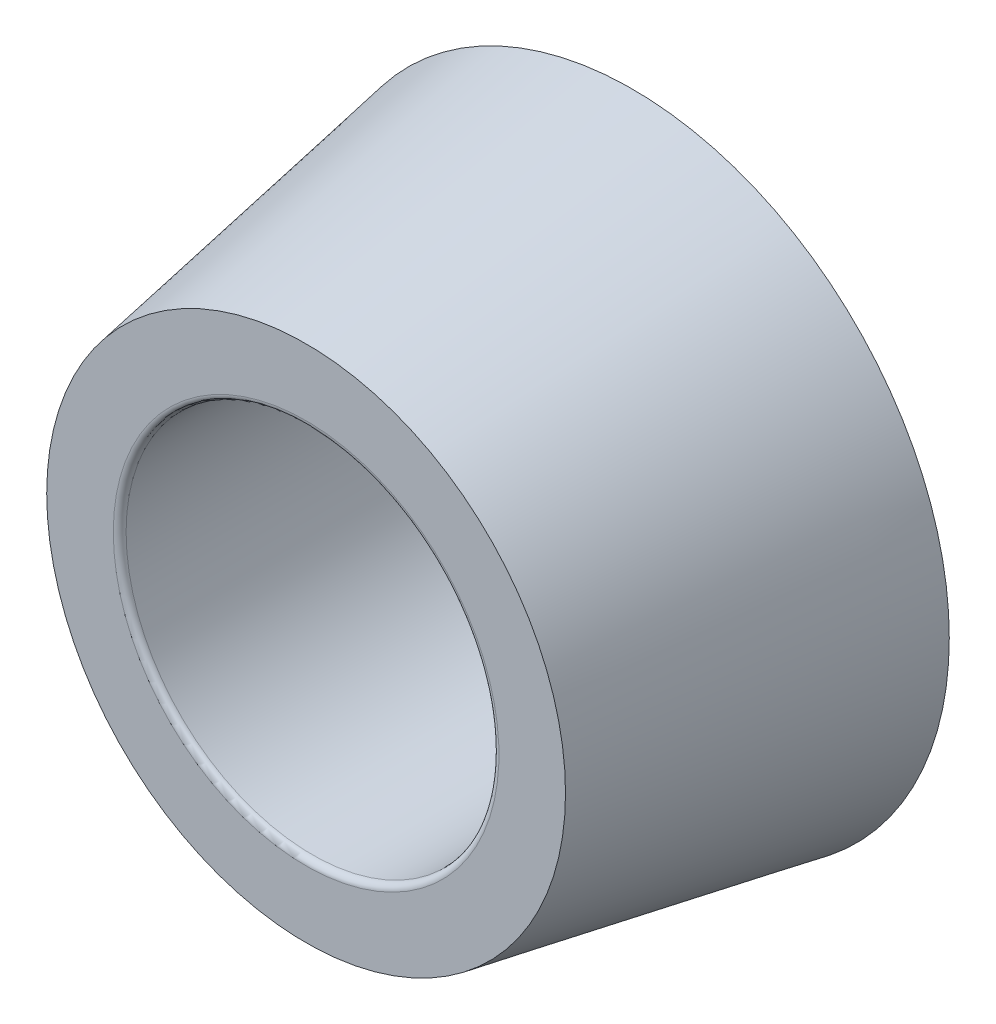
ISO-10303-21;
HEADER;
FILE_DESCRIPTION(('STEP AP214'),'2;1');
FILE_NAME('part.step','',(''),(''),'','','');
FILE_SCHEMA(('AUTOMOTIVE_DESIGN { 1 0 10303 214 1 1 1 1 }'));
ENDSEC;
DATA;
#1=APPLICATION_CONTEXT('core data for automotive mechanical design processes');
#2=APPLICATION_PROTOCOL_DEFINITION('international standard','automotive_design',2000,#1);
#3=PRODUCT_CONTEXT('',#1,'mechanical');
#4=PRODUCT('Part','Part','',(#3));
#5=PRODUCT_RELATED_PRODUCT_CATEGORY('part','',(#4));
#6=PRODUCT_DEFINITION_FORMATION('','',#4);
#7=PRODUCT_DEFINITION_CONTEXT('part definition',#1,'design');
#8=PRODUCT_DEFINITION('design','',#6,#7);
#9=PRODUCT_DEFINITION_SHAPE('','',#8);
#10=(LENGTH_UNIT() NAMED_UNIT(*) SI_UNIT(.MILLI.,.METRE.));
#11=(NAMED_UNIT(*) PLANE_ANGLE_UNIT() SI_UNIT($,.RADIAN.));
#12=(NAMED_UNIT(*) SI_UNIT($,.STERADIAN.) SOLID_ANGLE_UNIT());
#13=UNCERTAINTY_MEASURE_WITH_UNIT(LENGTH_MEASURE(1.E-05),#10,'distance_accuracy_value','');
#14=(GEOMETRIC_REPRESENTATION_CONTEXT(3) GLOBAL_UNCERTAINTY_ASSIGNED_CONTEXT((#13)) GLOBAL_UNIT_ASSIGNED_CONTEXT((#10,
#11,#12)) REPRESENTATION_CONTEXT('',''));
#15=CARTESIAN_POINT('',(0.,0.,0.));
#16=DIRECTION('',(0.,0.,1.));
#17=DIRECTION('',(1.,0.,0.));
#18=AXIS2_PLACEMENT_3D('',#15,#16,#17);
#19=CARTESIAN_POINT('',(0.,0.,5.33796875));
#20=DIRECTION('',(0.,0.,-1.));
#21=DIRECTION('',(-1.,0.,0.));
#22=AXIS2_PLACEMENT_3D('',#19,#20,#21);
#23=TOROIDAL_SURFACE('',#22,6.56828125,0.21828125);
#24=CARTESIAN_POINT('',(0.,0.,5.33796875));
#25=DIRECTION('',(0.,0.,-1.));
#26=DIRECTION('',(-1.,0.,0.));
#27=AXIS2_PLACEMENT_3D('',#24,#25,#26);
#28=CIRCLE('',#27,6.35);
#29=CARTESIAN_POINT('',(-6.35,0.,5.33796875));
#30=VERTEX_POINT('',#29);
#31=EDGE_CURVE('E10',#30,#30,#28,.T.);
#32=ORIENTED_EDGE('',*,*,#31,.T.);
#33=EDGE_LOOP('',(#32));
#34=FACE_BOUND('',#33,.T.);
#35=CARTESIAN_POINT('',(0.,0.,5.55625));
#36=DIRECTION('',(0.,0.,-1.));
#37=DIRECTION('',(-1.,0.,0.));
#38=AXIS2_PLACEMENT_3D('',#35,#36,#37);
#39=CIRCLE('',#38,6.56828125);
#40=CARTESIAN_POINT('',(-6.56828125,0.,5.55625));
#41=VERTEX_POINT('',#40);
#42=EDGE_CURVE('E28',#41,#41,#39,.T.);
#43=ORIENTED_EDGE('',*,*,#42,.F.);
#44=EDGE_LOOP('',(#43));
#45=FACE_BOUND('',#44,.T.);
#46=ADVANCED_FACE('F15',(#34,#45),#23,.T.);
#47=CARTESIAN_POINT('',(0.,0.,-5.33796875));
#48=DIRECTION('',(0.,0.,1.));
#49=DIRECTION('',(1.,0.,0.));
#50=AXIS2_PLACEMENT_3D('',#47,#48,#49);
#51=TOROIDAL_SURFACE('',#50,6.56828125,0.21828125);
#52=CARTESIAN_POINT('',(0.,0.,-5.33796875));
#53=DIRECTION('',(0.,0.,1.));
#54=DIRECTION('',(1.,0.,0.));
#55=AXIS2_PLACEMENT_3D('',#52,#53,#54);
#56=CIRCLE('',#55,6.35);
#57=CARTESIAN_POINT('',(6.35,0.,-5.33796875));
#58=VERTEX_POINT('',#57);
#59=EDGE_CURVE('E23',#58,#58,#56,.T.);
#60=ORIENTED_EDGE('',*,*,#59,.T.);
#61=EDGE_LOOP('',(#60));
#62=FACE_BOUND('',#61,.T.);
#63=CARTESIAN_POINT('',(0.,0.,-5.55625));
#64=DIRECTION('',(0.,0.,1.));
#65=DIRECTION('',(1.,0.,0.));
#66=AXIS2_PLACEMENT_3D('',#63,#64,#65);
#67=CIRCLE('',#66,6.56828125);
#68=CARTESIAN_POINT('',(6.56828125,0.,-5.55625));
#69=VERTEX_POINT('',#68);
#70=EDGE_CURVE('E34',#69,#69,#67,.T.);
#71=ORIENTED_EDGE('',*,*,#70,.F.);
#72=EDGE_LOOP('',(#71));
#73=FACE_BOUND('',#72,.T.);
#74=ADVANCED_FACE('F52',(#62,#73),#51,.T.);
#75=CARTESIAN_POINT('',(0.,8.83556642687722,5.55625));
#76=DIRECTION('',(0.,0.,-1.));
#77=DIRECTION('',(-1.,0.,0.));
#78=AXIS2_PLACEMENT_3D('',#75,#76,#77);
#79=PLANE('',#78);
#80=ORIENTED_EDGE('',*,*,#42,.T.);
#81=EDGE_LOOP('',(#80));
#82=FACE_BOUND('',#81,.T.);
#83=CARTESIAN_POINT('',(0.,0.,5.55625));
#84=DIRECTION('',(0.,0.,1.));
#85=DIRECTION('',(1.,0.,0.));
#86=AXIS2_PLACEMENT_3D('',#83,#84,#85);
#87=CIRCLE('',#86,8.83556642687722);
#88=CARTESIAN_POINT('',(8.83556642687722,0.,5.55625));
#89=VERTEX_POINT('',#88);
#90=EDGE_CURVE('E33',#89,#89,#87,.T.);
#91=ORIENTED_EDGE('',*,*,#90,.T.);
#92=EDGE_LOOP('',(#91));
#93=FACE_BOUND('',#92,.T.);
#94=ADVANCED_FACE('F39',(#82,#93),#79,.F.);
#95=CARTESIAN_POINT('',(0.,0.,5.55625));
#96=DIRECTION('',(0.,0.,1.));
#97=DIRECTION('',(1.,0.,0.));
#98=AXIS2_PLACEMENT_3D('',#95,#96,#97);
#99=CYLINDRICAL_SURFACE('',#98,6.35);
#100=ORIENTED_EDGE('',*,*,#31,.F.);
#101=EDGE_LOOP('',(#100));
#102=FACE_BOUND('',#101,.T.);
#103=ORIENTED_EDGE('',*,*,#59,.F.);
#104=EDGE_LOOP('',(#103));
#105=FACE_BOUND('',#104,.T.);
#106=ADVANCED_FACE('F48',(#102,#105),#99,.F.);
#107=CARTESIAN_POINT('',(0.,6.35,-5.55625));
#108=DIRECTION('',(0.,0.,1.));
#109=DIRECTION('',(1.,0.,0.));
#110=AXIS2_PLACEMENT_3D('',#107,#108,#109);
#111=PLANE('',#110);
#112=ORIENTED_EDGE('',*,*,#70,.T.);
#113=EDGE_LOOP('',(#112));
#114=FACE_BOUND('',#113,.T.);
#115=CARTESIAN_POINT('',(0.,0.,-5.55625));
#116=DIRECTION('',(0.,0.,1.));
#117=DIRECTION('',(1.,0.,0.));
#118=AXIS2_PLACEMENT_3D('',#115,#116,#117);
#119=CIRCLE('',#118,10.795);
#120=CARTESIAN_POINT('',(10.795,0.,-5.55625));
#121=VERTEX_POINT('',#120);
#122=EDGE_CURVE('E19',#121,#121,#119,.T.);
#123=ORIENTED_EDGE('',*,*,#122,.F.);
#124=EDGE_LOOP('',(#123));
#125=FACE_BOUND('',#124,.T.);
#126=ADVANCED_FACE('F42',(#114,#125),#111,.F.);
#127=CARTESIAN_POINT('',(0.,0.,-5.55625));
#128=DIRECTION('',(0.,0.,-1.));
#129=DIRECTION('',(-1.,0.,0.));
#130=AXIS2_PLACEMENT_3D('',#127,#128,#129);
#131=CONICAL_SURFACE('',#130,10.795,0.17453292519943);
#132=ORIENTED_EDGE('',*,*,#122,.T.);
#133=EDGE_LOOP('',(#132));
#134=FACE_BOUND('',#133,.T.);
#135=ORIENTED_EDGE('',*,*,#90,.F.);
#136=EDGE_LOOP('',(#135));
#137=FACE_BOUND('',#136,.T.);
#138=ADVANCED_FACE('F17',(#134,#137),#131,.T.);
#139=CLOSED_SHELL('',(#46,#74,#94,#106,#126,#138));
#140=MANIFOLD_SOLID_BREP('B1',#139);
#141=ADVANCED_BREP_SHAPE_REPRESENTATION('',(#18,#140),#14);
#142=SHAPE_DEFINITION_REPRESENTATION(#9,#141);
ENDSEC;
END-ISO-10303-21;
